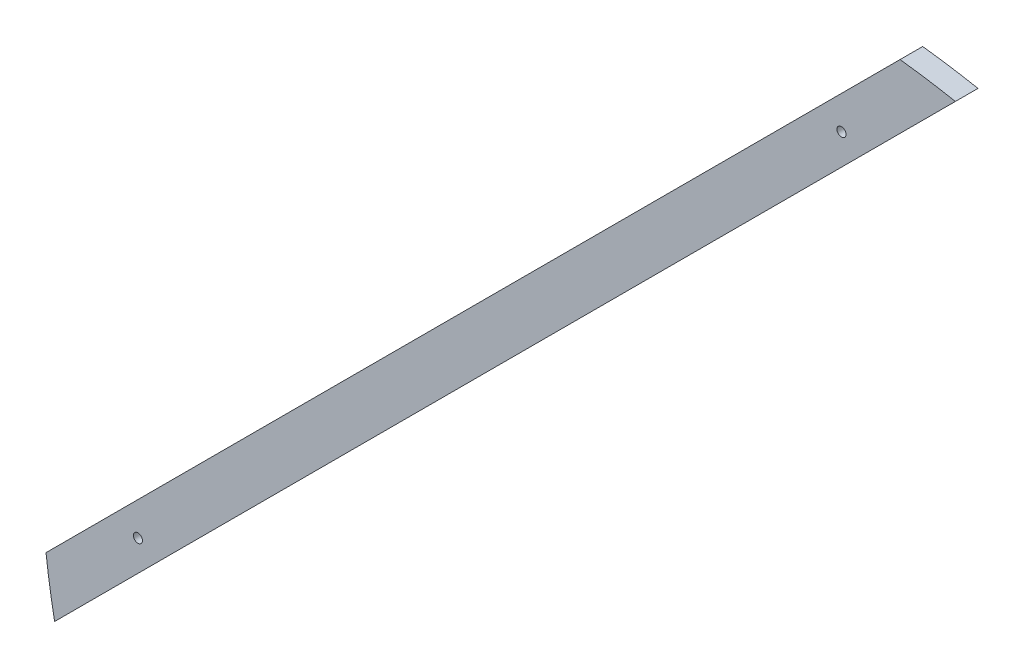
ISO-10303-21;
HEADER;
FILE_DESCRIPTION(('STEP AP214'),'2;1');
FILE_NAME('part.step','',(''),(''),'','','');
FILE_SCHEMA(('AUTOMOTIVE_DESIGN { 1 0 10303 214 1 1 1 1 }'));
ENDSEC;
DATA;
#1=APPLICATION_CONTEXT('core data for automotive mechanical design processes');
#2=APPLICATION_PROTOCOL_DEFINITION('international standard','automotive_design',2000,#1);
#3=PRODUCT_CONTEXT('',#1,'mechanical');
#4=PRODUCT('Part','Part','',(#3));
#5=PRODUCT_RELATED_PRODUCT_CATEGORY('part','',(#4));
#6=PRODUCT_DEFINITION_FORMATION('','',#4);
#7=PRODUCT_DEFINITION_CONTEXT('part definition',#1,'design');
#8=PRODUCT_DEFINITION('design','',#6,#7);
#9=PRODUCT_DEFINITION_SHAPE('','',#8);
#10=(LENGTH_UNIT() NAMED_UNIT(*) SI_UNIT(.MILLI.,.METRE.));
#11=(NAMED_UNIT(*) PLANE_ANGLE_UNIT() SI_UNIT($,.RADIAN.));
#12=(NAMED_UNIT(*) SI_UNIT($,.STERADIAN.) SOLID_ANGLE_UNIT());
#13=UNCERTAINTY_MEASURE_WITH_UNIT(LENGTH_MEASURE(1.E-05),#10,'distance_accuracy_value','');
#14=(GEOMETRIC_REPRESENTATION_CONTEXT(3) GLOBAL_UNCERTAINTY_ASSIGNED_CONTEXT((#13)) GLOBAL_UNIT_ASSIGNED_CONTEXT((#10,
#11,#12)) REPRESENTATION_CONTEXT('',''));
#15=CARTESIAN_POINT('',(0.,0.,0.));
#16=DIRECTION('',(0.,0.,1.));
#17=DIRECTION('',(1.,0.,0.));
#18=AXIS2_PLACEMENT_3D('',#15,#16,#17);
#19=CARTESIAN_POINT('',(0.,0.,5.));
#20=DIRECTION('',(0.,0.,-1.));
#21=DIRECTION('',(-1.,0.,0.));
#22=AXIS2_PLACEMENT_3D('',#19,#20,#21);
#23=CYLINDRICAL_SURFACE('',#22,170.);
#24=CARTESIAN_POINT('',(0.,0.,0.));
#25=DIRECTION('',(0.,0.,1.));
#26=DIRECTION('',(-1.,0.,0.));
#27=AXIS2_PLACEMENT_3D('',#24,#25,#26);
#28=CIRCLE('',#27,170.);
#29=CARTESIAN_POINT('',(32.2653385456761,166.909999486349,0.));
#30=VERTEX_POINT('',#29);
#31=CARTESIAN_POINT('',(20.0291747182503,168.815971282654,0.));
#32=VERTEX_POINT('',#31);
#33=EDGE_CURVE('E101',#30,#32,#28,.T.);
#34=ORIENTED_EDGE('',*,*,#33,.T.);
#35=DIRECTION('',(0.,0.,-1.));
#36=VECTOR('',#35,1.);
#37=CARTESIAN_POINT('',(20.0291747182503,168.815971282654,5.));
#38=LINE('',#37,#36);
#39=CARTESIAN_POINT('',(20.0291747182503,168.815971282654,5.));
#40=VERTEX_POINT('',#39);
#41=EDGE_CURVE('E11',#40,#32,#38,.T.);
#42=ORIENTED_EDGE('',*,*,#41,.F.);
#43=CARTESIAN_POINT('',(0.,0.,5.));
#44=DIRECTION('',(0.,0.,1.));
#45=DIRECTION('',(-1.,0.,0.));
#46=AXIS2_PLACEMENT_3D('',#43,#44,#45);
#47=CIRCLE('',#46,170.);
#48=CARTESIAN_POINT('',(32.2653385456761,166.909999486349,5.));
#49=VERTEX_POINT('',#48);
#50=EDGE_CURVE('E87',#49,#40,#47,.T.);
#51=ORIENTED_EDGE('',*,*,#50,.F.);
#52=DIRECTION('',(0.,0.,-1.));
#53=VECTOR('',#52,1.);
#54=CARTESIAN_POINT('',(32.2653385456761,166.909999486349,5.));
#55=LINE('',#54,#53);
#56=EDGE_CURVE('E97',#49,#30,#55,.T.);
#57=ORIENTED_EDGE('',*,*,#56,.T.);
#58=EDGE_LOOP('',(#34,#42,#51,#57));
#59=FACE_BOUND('',#58,.T.);
#60=ADVANCED_FACE('F37',(#59),#23,.T.);
#61=CARTESIAN_POINT('',(-168.815971282654,-20.0291747182521,5.));
#62=DIRECTION('',(0.707106781186551,-0.707106781186544,0.));
#63=DIRECTION('',(0.707106781186544,0.707106781186551,0.));
#64=AXIS2_PLACEMENT_3D('',#61,#62,#63);
#65=PLANE('',#64);
#66=DIRECTION('',(-0.707106781186544,-0.707106781186551,0.));
#67=VECTOR('',#66,1.);
#68=CARTESIAN_POINT('',(-168.815971282654,-20.0291747182521,0.));
#69=LINE('',#68,#67);
#70=CARTESIAN_POINT('',(-168.815971282654,-20.0291747182521,0.));
#71=VERTEX_POINT('',#70);
#72=EDGE_CURVE('E92',#32,#71,#69,.T.);
#73=ORIENTED_EDGE('',*,*,#72,.T.);
#74=DIRECTION('',(0.,0.,-1.));
#75=VECTOR('',#74,1.);
#76=CARTESIAN_POINT('',(-168.815971282654,-20.0291747182521,5.));
#77=LINE('',#76,#75);
#78=CARTESIAN_POINT('',(-168.815971282654,-20.0291747182521,5.));
#79=VERTEX_POINT('',#78);
#80=EDGE_CURVE('E45',#79,#71,#77,.T.);
#81=ORIENTED_EDGE('',*,*,#80,.F.);
#82=DIRECTION('',(-0.707106781186547,-0.707106781186548,0.));
#83=VECTOR('',#82,1.);
#84=CARTESIAN_POINT('',(20.0291747182503,168.815971282654,5.));
#85=LINE('',#84,#83);
#86=EDGE_CURVE('E81',#40,#79,#85,.T.);
#87=ORIENTED_EDGE('',*,*,#86,.F.);
#88=ORIENTED_EDGE('',*,*,#41,.T.);
#89=EDGE_LOOP('',(#73,#81,#87,#88));
#90=FACE_BOUND('',#89,.T.);
#91=ADVANCED_FACE('F91',(#90),#65,.F.);
#92=CARTESIAN_POINT('',(0.,0.,5.));
#93=DIRECTION('',(0.,0.,-1.));
#94=DIRECTION('',(-1.,0.,0.));
#95=AXIS2_PLACEMENT_3D('',#92,#93,#94);
#96=CYLINDRICAL_SURFACE('',#95,170.);
#97=CARTESIAN_POINT('',(0.,0.,0.));
#98=DIRECTION('',(0.,0.,1.));
#99=DIRECTION('',(1.,0.,0.));
#100=AXIS2_PLACEMENT_3D('',#97,#98,#99);
#101=CIRCLE('',#100,170.);
#102=CARTESIAN_POINT('',(-166.909999486348,-32.2653385456777,0.));
#103=VERTEX_POINT('',#102);
#104=EDGE_CURVE('E106',#71,#103,#101,.T.);
#105=ORIENTED_EDGE('',*,*,#104,.T.);
#106=DIRECTION('',(0.,0.,-1.));
#107=VECTOR('',#106,1.);
#108=CARTESIAN_POINT('',(-166.909999486348,-32.2653385456777,5.));
#109=LINE('',#108,#107);
#110=CARTESIAN_POINT('',(-166.909999486348,-32.2653385456777,5.));
#111=VERTEX_POINT('',#110);
#112=EDGE_CURVE('E94',#111,#103,#109,.T.);
#113=ORIENTED_EDGE('',*,*,#112,.F.);
#114=CARTESIAN_POINT('',(0.,0.,5.));
#115=DIRECTION('',(0.,0.,1.));
#116=DIRECTION('',(1.,0.,0.));
#117=AXIS2_PLACEMENT_3D('',#114,#115,#116);
#118=CIRCLE('',#117,170.);
#119=EDGE_CURVE('E84',#79,#111,#118,.T.);
#120=ORIENTED_EDGE('',*,*,#119,.F.);
#121=ORIENTED_EDGE('',*,*,#80,.T.);
#122=EDGE_LOOP('',(#105,#113,#120,#121));
#123=FACE_BOUND('',#122,.T.);
#124=ADVANCED_FACE('F95',(#123),#96,.T.);
#125=CARTESIAN_POINT('',(22.15049506181,156.795156002483,5.));
#126=DIRECTION('',(-0.707106781186548,0.707106781186547,0.));
#127=DIRECTION('',(-0.707106781186547,-0.707106781186548,0.));
#128=AXIS2_PLACEMENT_3D('',#125,#126,#127);
#129=PLANE('',#128);
#130=DIRECTION('',(0.707106781186547,0.707106781186548,0.));
#131=VECTOR('',#130,1.);
#132=CARTESIAN_POINT('',(22.15049506181,156.795156002483,0.));
#133=LINE('',#132,#131);
#134=EDGE_CURVE('E70',#103,#30,#133,.T.);
#135=ORIENTED_EDGE('',*,*,#134,.T.);
#136=ORIENTED_EDGE('',*,*,#56,.F.);
#137=DIRECTION('',(0.707106781186542,0.707106781186553,0.));
#138=VECTOR('',#137,1.);
#139=CARTESIAN_POINT('',(-156.795156002482,-22.1504950618117,5.));
#140=LINE('',#139,#138);
#141=EDGE_CURVE('E53',#111,#49,#140,.T.);
#142=ORIENTED_EDGE('',*,*,#141,.F.);
#143=ORIENTED_EDGE('',*,*,#112,.T.);
#144=EDGE_LOOP('',(#135,#136,#142,#143));
#145=FACE_BOUND('',#144,.T.);
#146=ADVANCED_FACE('F110',(#145),#129,.F.);
#147=CARTESIAN_POINT('',(0.,0.,5.));
#148=DIRECTION('',(0.,0.,-1.));
#149=DIRECTION('',(-1.,0.,0.));
#150=AXIS2_PLACEMENT_3D('',#147,#148,#149);
#151=PLANE('',#150);
#152=CARTESIAN_POINT('',(-148.492424049175,-7.07106781186546,5.));
#153=DIRECTION('',(0.,0.,-1.));
#154=DIRECTION('',(-1.,0.,0.));
#155=AXIS2_PLACEMENT_3D('',#152,#153,#154);
#156=CIRCLE('',#155,0.999999999999998);
#157=CARTESIAN_POINT('',(-149.492424049175,-7.07106781186546,5.));
#158=VERTEX_POINT('',#157);
#159=EDGE_CURVE('E104',#158,#158,#156,.T.);
#160=ORIENTED_EDGE('',*,*,#159,.T.);
#161=EDGE_LOOP('',(#160));
#162=FACE_BOUND('',#161,.T.);
#163=CARTESIAN_POINT('',(7.07106781186545,148.492424049175,5.));
#164=DIRECTION('',(0.,0.,-1.));
#165=DIRECTION('',(-1.,0.,0.));
#166=AXIS2_PLACEMENT_3D('',#163,#164,#165);
#167=CIRCLE('',#166,1.);
#168=CARTESIAN_POINT('',(6.07106781186545,148.492424049175,5.));
#169=VERTEX_POINT('',#168);
#170=EDGE_CURVE('E116',#169,#169,#167,.T.);
#171=ORIENTED_EDGE('',*,*,#170,.T.);
#172=EDGE_LOOP('',(#171));
#173=FACE_BOUND('',#172,.T.);
#174=ORIENTED_EDGE('',*,*,#50,.T.);
#175=ORIENTED_EDGE('',*,*,#86,.T.);
#176=ORIENTED_EDGE('',*,*,#119,.T.);
#177=ORIENTED_EDGE('',*,*,#141,.T.);
#178=EDGE_LOOP('',(#174,#175,#176,#177));
#179=FACE_BOUND('',#178,.T.);
#180=ADVANCED_FACE('F82',(#162,#173,#179),#151,.F.);
#181=CARTESIAN_POINT('',(0.,0.,0.));
#182=DIRECTION('',(0.,0.,-1.));
#183=DIRECTION('',(-1.,0.,0.));
#184=AXIS2_PLACEMENT_3D('',#181,#182,#183);
#185=PLANE('',#184);
#186=CARTESIAN_POINT('',(-148.492424049175,-7.07106781186546,0.));
#187=DIRECTION('',(0.,0.,-1.));
#188=DIRECTION('',(-1.,0.,0.));
#189=AXIS2_PLACEMENT_3D('',#186,#187,#188);
#190=CIRCLE('',#189,0.999999999999998);
#191=CARTESIAN_POINT('',(-149.492424049175,-7.07106781186546,0.));
#192=VERTEX_POINT('',#191);
#193=EDGE_CURVE('E119',#192,#192,#190,.T.);
#194=ORIENTED_EDGE('',*,*,#193,.F.);
#195=EDGE_LOOP('',(#194));
#196=FACE_BOUND('',#195,.T.);
#197=CARTESIAN_POINT('',(7.07106781186545,148.492424049175,0.));
#198=DIRECTION('',(0.,0.,-1.));
#199=DIRECTION('',(-1.,0.,0.));
#200=AXIS2_PLACEMENT_3D('',#197,#198,#199);
#201=CIRCLE('',#200,1.);
#202=CARTESIAN_POINT('',(6.07106781186545,148.492424049175,0.));
#203=VERTEX_POINT('',#202);
#204=EDGE_CURVE('E113',#203,#203,#201,.T.);
#205=ORIENTED_EDGE('',*,*,#204,.F.);
#206=EDGE_LOOP('',(#205));
#207=FACE_BOUND('',#206,.T.);
#208=ORIENTED_EDGE('',*,*,#33,.F.);
#209=ORIENTED_EDGE('',*,*,#134,.F.);
#210=ORIENTED_EDGE('',*,*,#104,.F.);
#211=ORIENTED_EDGE('',*,*,#72,.F.);
#212=EDGE_LOOP('',(#208,#209,#210,#211));
#213=FACE_BOUND('',#212,.T.);
#214=ADVANCED_FACE('F134',(#196,#207,#213),#185,.T.);
#215=CARTESIAN_POINT('',(7.07106781186545,148.492424049175,5.));
#216=DIRECTION('',(0.,0.,-1.));
#217=DIRECTION('',(-1.,0.,0.));
#218=AXIS2_PLACEMENT_3D('',#215,#216,#217);
#219=CYLINDRICAL_SURFACE('',#218,1.);
#220=ORIENTED_EDGE('',*,*,#170,.F.);
#221=EDGE_LOOP('',(#220));
#222=FACE_BOUND('',#221,.T.);
#223=ORIENTED_EDGE('',*,*,#204,.T.);
#224=EDGE_LOOP('',(#223));
#225=FACE_BOUND('',#224,.T.);
#226=ADVANCED_FACE('F130',(#222,#225),#219,.F.);
#227=CARTESIAN_POINT('',(-148.492424049175,-7.07106781186546,5.));
#228=DIRECTION('',(0.,0.,-1.));
#229=DIRECTION('',(-1.,0.,0.));
#230=AXIS2_PLACEMENT_3D('',#227,#228,#229);
#231=CYLINDRICAL_SURFACE('',#230,0.999999999999998);
#232=ORIENTED_EDGE('',*,*,#159,.F.);
#233=EDGE_LOOP('',(#232));
#234=FACE_BOUND('',#233,.T.);
#235=ORIENTED_EDGE('',*,*,#193,.T.);
#236=EDGE_LOOP('',(#235));
#237=FACE_BOUND('',#236,.T.);
#238=ADVANCED_FACE('F127',(#234,#237),#231,.F.);
#239=CLOSED_SHELL('',(#60,#91,#124,#146,#180,#214,#226,#238));
#240=MANIFOLD_SOLID_BREP('B2',#239);
#241=ADVANCED_BREP_SHAPE_REPRESENTATION('',(#18,#240),#14);
#242=SHAPE_DEFINITION_REPRESENTATION(#9,#241);
ENDSEC;
END-ISO-10303-21;
